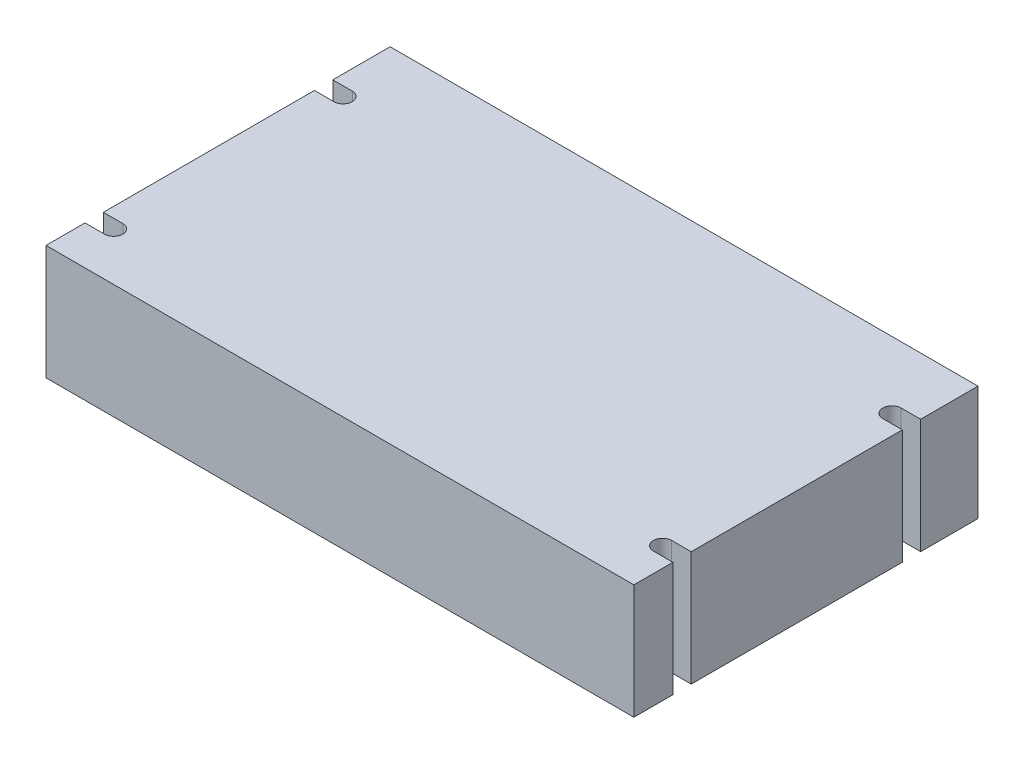
ISO-10303-21;
HEADER;
FILE_DESCRIPTION(('STEP AP214'),'2;1');
FILE_NAME('part.step','',(''),(''),'','','');
FILE_SCHEMA(('AUTOMOTIVE_DESIGN { 1 0 10303 214 1 1 1 1 }'));
ENDSEC;
DATA;
#1=APPLICATION_CONTEXT('core data for automotive mechanical design processes');
#2=APPLICATION_PROTOCOL_DEFINITION('international standard','automotive_design',2000,#1);
#3=PRODUCT_CONTEXT('',#1,'mechanical');
#4=PRODUCT('Part','Part','',(#3));
#5=PRODUCT_RELATED_PRODUCT_CATEGORY('part','',(#4));
#6=PRODUCT_DEFINITION_FORMATION('','',#4);
#7=PRODUCT_DEFINITION_CONTEXT('part definition',#1,'design');
#8=PRODUCT_DEFINITION('design','',#6,#7);
#9=PRODUCT_DEFINITION_SHAPE('','',#8);
#10=(LENGTH_UNIT() NAMED_UNIT(*) SI_UNIT(.MILLI.,.METRE.));
#11=(NAMED_UNIT(*) PLANE_ANGLE_UNIT() SI_UNIT($,.RADIAN.));
#12=(NAMED_UNIT(*) SI_UNIT($,.STERADIAN.) SOLID_ANGLE_UNIT());
#13=UNCERTAINTY_MEASURE_WITH_UNIT(LENGTH_MEASURE(1.E-05),#10,'distance_accuracy_value','');
#14=(GEOMETRIC_REPRESENTATION_CONTEXT(3) GLOBAL_UNCERTAINTY_ASSIGNED_CONTEXT((#13)) GLOBAL_UNIT_ASSIGNED_CONTEXT((#10,
#11,#12)) REPRESENTATION_CONTEXT('',''));
#15=CARTESIAN_POINT('',(0.,0.,0.));
#16=DIRECTION('',(0.,0.,1.));
#17=DIRECTION('',(1.,0.,0.));
#18=AXIS2_PLACEMENT_3D('',#15,#16,#17);
#19=CARTESIAN_POINT('',(65.0875,25.4,38.1));
#20=DIRECTION('',(-1.,0.,0.));
#21=DIRECTION('',(0.,0.,1.));
#22=AXIS2_PLACEMENT_3D('',#19,#20,#21);
#23=PLANE('',#22);
#24=DIRECTION('',(0.,1.,0.));
#25=VECTOR('',#24,1.);
#26=CARTESIAN_POINT('',(65.0875,0.,25.4));
#27=LINE('',#26,#25);
#28=CARTESIAN_POINT('',(65.0875,0.,25.4));
#29=VERTEX_POINT('',#28);
#30=CARTESIAN_POINT('',(65.0875,25.4,25.4));
#31=VERTEX_POINT('',#30);
#32=EDGE_CURVE('E207',#29,#31,#27,.T.);
#33=ORIENTED_EDGE('',*,*,#32,.F.);
#34=DIRECTION('',(0.,0.,-1.));
#35=VECTOR('',#34,1.);
#36=CARTESIAN_POINT('',(65.0875,0.,38.1));
#37=LINE('',#36,#35);
#38=CARTESIAN_POINT('',(65.0875,0.,-21.336));
#39=VERTEX_POINT('',#38);
#40=EDGE_CURVE('E302',#29,#39,#37,.T.);
#41=ORIENTED_EDGE('',*,*,#40,.T.);
#42=DIRECTION('',(0.,1.,0.));
#43=VECTOR('',#42,1.);
#44=CARTESIAN_POINT('',(65.0875,0.,-21.336));
#45=LINE('',#44,#43);
#46=CARTESIAN_POINT('',(65.0875,25.4,-21.336));
#47=VERTEX_POINT('',#46);
#48=EDGE_CURVE('E52',#39,#47,#45,.T.);
#49=ORIENTED_EDGE('',*,*,#48,.T.);
#50=DIRECTION('',(0.,0.,-1.));
#51=VECTOR('',#50,1.);
#52=CARTESIAN_POINT('',(65.0875,25.4,38.1));
#53=LINE('',#52,#51);
#54=EDGE_CURVE('E288',#31,#47,#53,.T.);
#55=ORIENTED_EDGE('',*,*,#54,.F.);
#56=EDGE_LOOP('',(#33,#41,#49,#55));
#57=FACE_BOUND('',#56,.T.);
#58=ADVANCED_FACE('F38',(#57),#23,.F.);
#59=DIRECTION('',(0.,1.,0.));
#60=VECTOR('',#59,1.);
#61=CARTESIAN_POINT('',(65.0875,0.,29.464));
#62=LINE('',#61,#60);
#63=CARTESIAN_POINT('',(65.0875,0.,29.464));
#64=VERTEX_POINT('',#63);
#65=CARTESIAN_POINT('',(65.0875,25.4,29.464));
#66=VERTEX_POINT('',#65);
#67=EDGE_CURVE('E60',#64,#66,#62,.T.);
#68=ORIENTED_EDGE('',*,*,#67,.T.);
#69=CARTESIAN_POINT('',(65.0875,25.4,38.1));
#70=VERTEX_POINT('',#69);
#71=EDGE_CURVE('E284',#70,#66,#53,.T.);
#72=ORIENTED_EDGE('',*,*,#71,.F.);
#73=DIRECTION('',(0.,-1.,0.));
#74=VECTOR('',#73,1.);
#75=CARTESIAN_POINT('',(65.0875,25.4,38.1));
#76=LINE('',#75,#74);
#77=CARTESIAN_POINT('',(65.0875,0.,38.1));
#78=VERTEX_POINT('',#77);
#79=EDGE_CURVE('E298',#70,#78,#76,.T.);
#80=ORIENTED_EDGE('',*,*,#79,.T.);
#81=EDGE_CURVE('E299',#78,#64,#37,.T.);
#82=ORIENTED_EDGE('',*,*,#81,.T.);
#83=EDGE_LOOP('',(#68,#72,#80,#82));
#84=FACE_BOUND('',#83,.T.);
#85=ADVANCED_FACE('F363',(#84),#23,.F.);
#86=DIRECTION('',(0.,1.,0.));
#87=VECTOR('',#86,1.);
#88=CARTESIAN_POINT('',(65.0875,0.,-25.4));
#89=LINE('',#88,#87);
#90=CARTESIAN_POINT('',(65.0875,0.,-25.4));
#91=VERTEX_POINT('',#90);
#92=CARTESIAN_POINT('',(65.0875,25.4,-25.4));
#93=VERTEX_POINT('',#92);
#94=EDGE_CURVE('E228',#91,#93,#89,.T.);
#95=ORIENTED_EDGE('',*,*,#94,.F.);
#96=CARTESIAN_POINT('',(65.0875,0.,-38.1));
#97=VERTEX_POINT('',#96);
#98=EDGE_CURVE('E253',#91,#97,#37,.T.);
#99=ORIENTED_EDGE('',*,*,#98,.T.);
#100=DIRECTION('',(0.,-1.,0.));
#101=VECTOR('',#100,1.);
#102=CARTESIAN_POINT('',(65.0875,25.4,-38.1));
#103=LINE('',#102,#101);
#104=CARTESIAN_POINT('',(65.0875,25.4,-38.1));
#105=VERTEX_POINT('',#104);
#106=EDGE_CURVE('E11',#105,#97,#103,.T.);
#107=ORIENTED_EDGE('',*,*,#106,.F.);
#108=EDGE_CURVE('E289',#93,#105,#53,.T.);
#109=ORIENTED_EDGE('',*,*,#108,.F.);
#110=EDGE_LOOP('',(#95,#99,#107,#109));
#111=FACE_BOUND('',#110,.T.);
#112=ADVANCED_FACE('F338',(#111),#23,.F.);
#113=CARTESIAN_POINT('',(0.,25.4,0.));
#114=DIRECTION('',(0.,-1.,0.));
#115=DIRECTION('',(0.,0.,-1.));
#116=AXIS2_PLACEMENT_3D('',#113,#114,#115);
#117=PLANE('',#116);
#118=DIRECTION('',(1.,0.,0.));
#119=VECTOR('',#118,1.);
#120=CARTESIAN_POINT('',(60.7695,25.4,25.4));
#121=LINE('',#120,#119);
#122=CARTESIAN_POINT('',(60.7695,25.4,25.4));
#123=VERTEX_POINT('',#122);
#124=EDGE_CURVE('E194',#123,#31,#121,.T.);
#125=ORIENTED_EDGE('',*,*,#124,.T.);
#126=ORIENTED_EDGE('',*,*,#54,.T.);
#127=DIRECTION('',(-1.,0.,0.));
#128=VECTOR('',#127,1.);
#129=CARTESIAN_POINT('',(60.7695,25.4,-21.336));
#130=LINE('',#129,#128);
#131=CARTESIAN_POINT('',(60.7695,25.4,-21.336));
#132=VERTEX_POINT('',#131);
#133=EDGE_CURVE('E221',#47,#132,#130,.T.);
#134=ORIENTED_EDGE('',*,*,#133,.T.);
#135=CARTESIAN_POINT('',(60.7695,25.4,-23.368));
#136=DIRECTION('',(0.,-1.,0.));
#137=DIRECTION('',(0.,0.,1.));
#138=AXIS2_PLACEMENT_3D('',#135,#136,#137);
#139=CIRCLE('',#138,2.032);
#140=CARTESIAN_POINT('',(60.7695,25.4,-25.4));
#141=VERTEX_POINT('',#140);
#142=EDGE_CURVE('E218',#132,#141,#139,.T.);
#143=ORIENTED_EDGE('',*,*,#142,.T.);
#144=DIRECTION('',(1.,0.,0.));
#145=VECTOR('',#144,1.);
#146=CARTESIAN_POINT('',(60.7695,25.4,-25.4));
#147=LINE('',#146,#145);
#148=EDGE_CURVE('E213',#141,#93,#147,.T.);
#149=ORIENTED_EDGE('',*,*,#148,.T.);
#150=ORIENTED_EDGE('',*,*,#108,.T.);
#151=DIRECTION('',(-1.,0.,0.));
#152=VECTOR('',#151,1.);
#153=CARTESIAN_POINT('',(-65.0875,25.4,-38.1));
#154=LINE('',#153,#152);
#155=CARTESIAN_POINT('',(-65.0875,25.4,-38.1));
#156=VERTEX_POINT('',#155);
#157=EDGE_CURVE('E287',#105,#156,#154,.T.);
#158=ORIENTED_EDGE('',*,*,#157,.T.);
#159=DIRECTION('',(0.,0.,1.));
#160=VECTOR('',#159,1.);
#161=CARTESIAN_POINT('',(-65.0875,25.4,38.1));
#162=LINE('',#161,#160);
#163=CARTESIAN_POINT('',(-65.0875,25.4,-25.4));
#164=VERTEX_POINT('',#163);
#165=EDGE_CURVE('E292',#156,#164,#162,.T.);
#166=ORIENTED_EDGE('',*,*,#165,.T.);
#167=DIRECTION('',(-1.,0.,0.));
#168=VECTOR('',#167,1.);
#169=CARTESIAN_POINT('',(-60.7695,25.4,-25.4));
#170=LINE('',#169,#168);
#171=CARTESIAN_POINT('',(-60.7695,25.4,-25.4));
#172=VERTEX_POINT('',#171);
#173=EDGE_CURVE('E273',#172,#164,#170,.T.);
#174=ORIENTED_EDGE('',*,*,#173,.F.);
#175=CARTESIAN_POINT('',(-60.7695,25.4,-23.368));
#176=DIRECTION('',(0.,1.,0.));
#177=DIRECTION('',(0.,0.,1.));
#178=AXIS2_PLACEMENT_3D('',#175,#176,#177);
#179=CIRCLE('',#178,2.032);
#180=CARTESIAN_POINT('',(-60.7695,25.4,-21.336));
#181=VERTEX_POINT('',#180);
#182=EDGE_CURVE('E206',#181,#172,#179,.T.);
#183=ORIENTED_EDGE('',*,*,#182,.F.);
#184=DIRECTION('',(1.,0.,0.));
#185=VECTOR('',#184,1.);
#186=CARTESIAN_POINT('',(-60.7695,25.4,-21.336));
#187=LINE('',#186,#185);
#188=CARTESIAN_POINT('',(-65.0875,25.4,-21.336));
#189=VERTEX_POINT('',#188);
#190=EDGE_CURVE('E264',#189,#181,#187,.T.);
#191=ORIENTED_EDGE('',*,*,#190,.F.);
#192=CARTESIAN_POINT('',(-65.0875,25.4,25.4));
#193=VERTEX_POINT('',#192);
#194=EDGE_CURVE('E296',#189,#193,#162,.T.);
#195=ORIENTED_EDGE('',*,*,#194,.T.);
#196=DIRECTION('',(-1.,0.,0.));
#197=VECTOR('',#196,1.);
#198=CARTESIAN_POINT('',(-60.7695,25.4,25.4));
#199=LINE('',#198,#197);
#200=CARTESIAN_POINT('',(-60.7695,25.4,25.4));
#201=VERTEX_POINT('',#200);
#202=EDGE_CURVE('E246',#201,#193,#199,.T.);
#203=ORIENTED_EDGE('',*,*,#202,.F.);
#204=CARTESIAN_POINT('',(-60.7695,25.4,27.432));
#205=DIRECTION('',(0.,1.,0.));
#206=DIRECTION('',(0.,0.,1.));
#207=AXIS2_PLACEMENT_3D('',#204,#205,#206);
#208=CIRCLE('',#207,2.032);
#209=CARTESIAN_POINT('',(-60.7695,25.4,29.464));
#210=VERTEX_POINT('',#209);
#211=EDGE_CURVE('E243',#210,#201,#208,.T.);
#212=ORIENTED_EDGE('',*,*,#211,.F.);
#213=DIRECTION('',(1.,0.,0.));
#214=VECTOR('',#213,1.);
#215=CARTESIAN_POINT('',(-65.0875,25.4,29.464));
#216=LINE('',#215,#214);
#217=CARTESIAN_POINT('',(-65.0875,25.4,29.464));
#218=VERTEX_POINT('',#217);
#219=EDGE_CURVE('E236',#218,#210,#216,.T.);
#220=ORIENTED_EDGE('',*,*,#219,.F.);
#221=CARTESIAN_POINT('',(-65.0875,25.4,38.1));
#222=VERTEX_POINT('',#221);
#223=EDGE_CURVE('E291',#218,#222,#162,.T.);
#224=ORIENTED_EDGE('',*,*,#223,.T.);
#225=DIRECTION('',(1.,0.,0.));
#226=VECTOR('',#225,1.);
#227=CARTESIAN_POINT('',(-65.0875,25.4,38.1));
#228=LINE('',#227,#226);
#229=EDGE_CURVE('E295',#222,#70,#228,.T.);
#230=ORIENTED_EDGE('',*,*,#229,.T.);
#231=ORIENTED_EDGE('',*,*,#71,.T.);
#232=DIRECTION('',(-1.,0.,0.));
#233=VECTOR('',#232,1.);
#234=CARTESIAN_POINT('',(65.0875,25.4,29.464));
#235=LINE('',#234,#233);
#236=CARTESIAN_POINT('',(60.7695,25.4,29.464));
#237=VERTEX_POINT('',#236);
#238=EDGE_CURVE('E197',#66,#237,#235,.T.);
#239=ORIENTED_EDGE('',*,*,#238,.T.);
#240=CARTESIAN_POINT('',(60.7695,25.4,27.432));
#241=DIRECTION('',(0.,-1.,0.));
#242=DIRECTION('',(0.,0.,1.));
#243=AXIS2_PLACEMENT_3D('',#240,#241,#242);
#244=CIRCLE('',#243,2.032);
#245=EDGE_CURVE('E188',#237,#123,#244,.T.);
#246=ORIENTED_EDGE('',*,*,#245,.T.);
#247=EDGE_LOOP('',(#125,#126,#134,#143,#149,#150,#158,#166,#174,#183,#191,#195,#203,#212,#220,
#224,#230,#231,#239,#246));
#248=FACE_BOUND('',#247,.T.);
#249=ADVANCED_FACE('F331',(#248),#117,.F.);
#250=CARTESIAN_POINT('',(0.,0.,0.));
#251=DIRECTION('',(0.,-1.,0.));
#252=DIRECTION('',(0.,0.,-1.));
#253=AXIS2_PLACEMENT_3D('',#250,#251,#252);
#254=PLANE('',#253);
#255=ORIENTED_EDGE('',*,*,#40,.F.);
#256=DIRECTION('',(1.,0.,0.));
#257=VECTOR('',#256,1.);
#258=CARTESIAN_POINT('',(60.7695,0.,25.4));
#259=LINE('',#258,#257);
#260=CARTESIAN_POINT('',(60.7695,0.,25.4));
#261=VERTEX_POINT('',#260);
#262=EDGE_CURVE('E180',#261,#29,#259,.T.);
#263=ORIENTED_EDGE('',*,*,#262,.F.);
#264=CARTESIAN_POINT('',(60.7695,0.,27.432));
#265=DIRECTION('',(0.,-1.,0.));
#266=DIRECTION('',(0.,0.,1.));
#267=AXIS2_PLACEMENT_3D('',#264,#265,#266);
#268=CIRCLE('',#267,2.032);
#269=CARTESIAN_POINT('',(60.7695,0.,29.464));
#270=VERTEX_POINT('',#269);
#271=EDGE_CURVE('E181',#270,#261,#268,.T.);
#272=ORIENTED_EDGE('',*,*,#271,.F.);
#273=DIRECTION('',(-1.,0.,0.));
#274=VECTOR('',#273,1.);
#275=CARTESIAN_POINT('',(65.0875,0.,29.464));
#276=LINE('',#275,#274);
#277=EDGE_CURVE('E171',#64,#270,#276,.T.);
#278=ORIENTED_EDGE('',*,*,#277,.F.);
#279=ORIENTED_EDGE('',*,*,#81,.F.);
#280=DIRECTION('',(1.,0.,0.));
#281=VECTOR('',#280,1.);
#282=CARTESIAN_POINT('',(-65.0875,0.,38.1));
#283=LINE('',#282,#281);
#284=CARTESIAN_POINT('',(-65.0875,0.,38.1));
#285=VERTEX_POINT('',#284);
#286=EDGE_CURVE('E308',#285,#78,#283,.T.);
#287=ORIENTED_EDGE('',*,*,#286,.F.);
#288=DIRECTION('',(0.,0.,1.));
#289=VECTOR('',#288,1.);
#290=CARTESIAN_POINT('',(-65.0875,0.,38.1));
#291=LINE('',#290,#289);
#292=CARTESIAN_POINT('',(-65.0875,0.,29.464));
#293=VERTEX_POINT('',#292);
#294=EDGE_CURVE('E304',#293,#285,#291,.T.);
#295=ORIENTED_EDGE('',*,*,#294,.F.);
#296=DIRECTION('',(1.,0.,0.));
#297=VECTOR('',#296,1.);
#298=CARTESIAN_POINT('',(-65.0875,0.,29.464));
#299=LINE('',#298,#297);
#300=CARTESIAN_POINT('',(-60.7695,0.,29.464));
#301=VERTEX_POINT('',#300);
#302=EDGE_CURVE('E239',#293,#301,#299,.T.);
#303=ORIENTED_EDGE('',*,*,#302,.T.);
#304=CARTESIAN_POINT('',(-60.7695,0.,27.432));
#305=DIRECTION('',(0.,1.,0.));
#306=DIRECTION('',(0.,0.,1.));
#307=AXIS2_PLACEMENT_3D('',#304,#305,#306);
#308=CIRCLE('',#307,2.032);
#309=CARTESIAN_POINT('',(-60.7695,0.,25.4));
#310=VERTEX_POINT('',#309);
#311=EDGE_CURVE('E232',#301,#310,#308,.T.);
#312=ORIENTED_EDGE('',*,*,#311,.T.);
#313=DIRECTION('',(-1.,0.,0.));
#314=VECTOR('',#313,1.);
#315=CARTESIAN_POINT('',(-60.7695,0.,25.4));
#316=LINE('',#315,#314);
#317=CARTESIAN_POINT('',(-65.0875,0.,25.4));
#318=VERTEX_POINT('',#317);
#319=EDGE_CURVE('E235',#310,#318,#316,.T.);
#320=ORIENTED_EDGE('',*,*,#319,.T.);
#321=CARTESIAN_POINT('',(-65.0875,0.,-21.336));
#322=VERTEX_POINT('',#321);
#323=EDGE_CURVE('E309',#322,#318,#291,.T.);
#324=ORIENTED_EDGE('',*,*,#323,.F.);
#325=DIRECTION('',(1.,0.,0.));
#326=VECTOR('',#325,1.);
#327=CARTESIAN_POINT('',(-60.7695,0.,-21.336));
#328=LINE('',#327,#326);
#329=CARTESIAN_POINT('',(-60.7695,0.,-21.336));
#330=VERTEX_POINT('',#329);
#331=EDGE_CURVE('E267',#322,#330,#328,.T.);
#332=ORIENTED_EDGE('',*,*,#331,.T.);
#333=CARTESIAN_POINT('',(-60.7695,0.,-23.368));
#334=DIRECTION('',(0.,1.,0.));
#335=DIRECTION('',(0.,0.,1.));
#336=AXIS2_PLACEMENT_3D('',#333,#334,#335);
#337=CIRCLE('',#336,2.032);
#338=CARTESIAN_POINT('',(-60.7695,0.,-25.4));
#339=VERTEX_POINT('',#338);
#340=EDGE_CURVE('E260',#330,#339,#337,.T.);
#341=ORIENTED_EDGE('',*,*,#340,.T.);
#342=DIRECTION('',(-1.,0.,0.));
#343=VECTOR('',#342,1.);
#344=CARTESIAN_POINT('',(-60.7695,0.,-25.4));
#345=LINE('',#344,#343);
#346=CARTESIAN_POINT('',(-65.0875,0.,-25.4));
#347=VERTEX_POINT('',#346);
#348=EDGE_CURVE('E263',#339,#347,#345,.T.);
#349=ORIENTED_EDGE('',*,*,#348,.T.);
#350=CARTESIAN_POINT('',(-65.0875,0.,-38.1));
#351=VERTEX_POINT('',#350);
#352=EDGE_CURVE('E305',#351,#347,#291,.T.);
#353=ORIENTED_EDGE('',*,*,#352,.F.);
#354=DIRECTION('',(-1.,0.,0.));
#355=VECTOR('',#354,1.);
#356=CARTESIAN_POINT('',(-65.0875,0.,-38.1));
#357=LINE('',#356,#355);
#358=EDGE_CURVE('E301',#97,#351,#357,.T.);
#359=ORIENTED_EDGE('',*,*,#358,.F.);
#360=ORIENTED_EDGE('',*,*,#98,.F.);
#361=DIRECTION('',(1.,0.,0.));
#362=VECTOR('',#361,1.);
#363=CARTESIAN_POINT('',(60.7695,0.,-25.4));
#364=LINE('',#363,#362);
#365=CARTESIAN_POINT('',(60.7695,0.,-25.4));
#366=VERTEX_POINT('',#365);
#367=EDGE_CURVE('E215',#366,#91,#364,.T.);
#368=ORIENTED_EDGE('',*,*,#367,.F.);
#369=CARTESIAN_POINT('',(60.7695,0.,-23.368));
#370=DIRECTION('',(0.,-1.,0.));
#371=DIRECTION('',(0.,0.,1.));
#372=AXIS2_PLACEMENT_3D('',#369,#370,#371);
#373=CIRCLE('',#372,2.032);
#374=CARTESIAN_POINT('',(60.7695,0.,-21.336));
#375=VERTEX_POINT('',#374);
#376=EDGE_CURVE('E210',#375,#366,#373,.T.);
#377=ORIENTED_EDGE('',*,*,#376,.F.);
#378=DIRECTION('',(-1.,0.,0.));
#379=VECTOR('',#378,1.);
#380=CARTESIAN_POINT('',(60.7695,0.,-21.336));
#381=LINE('',#380,#379);
#382=EDGE_CURVE('E212',#39,#375,#381,.T.);
#383=ORIENTED_EDGE('',*,*,#382,.F.);
#384=EDGE_LOOP('',(#255,#263,#272,#278,#279,#287,#295,#303,#312,#320,#324,#332,#341,#349,#353,
#359,#360,#368,#377,#383));
#385=FACE_BOUND('',#384,.T.);
#386=ADVANCED_FACE('F193',(#385),#254,.T.);
#387=CARTESIAN_POINT('',(-65.0875,25.4,38.1));
#388=DIRECTION('',(1.,0.,0.));
#389=DIRECTION('',(0.,0.,-1.));
#390=AXIS2_PLACEMENT_3D('',#387,#388,#389);
#391=PLANE('',#390);
#392=ORIENTED_EDGE('',*,*,#223,.F.);
#393=DIRECTION('',(0.,1.,0.));
#394=VECTOR('',#393,1.);
#395=CARTESIAN_POINT('',(-65.0875,0.,29.464));
#396=LINE('',#395,#394);
#397=EDGE_CURVE('E254',#293,#218,#396,.T.);
#398=ORIENTED_EDGE('',*,*,#397,.F.);
#399=ORIENTED_EDGE('',*,*,#294,.T.);
#400=DIRECTION('',(0.,-1.,0.));
#401=VECTOR('',#400,1.);
#402=CARTESIAN_POINT('',(-65.0875,25.4,38.1));
#403=LINE('',#402,#401);
#404=EDGE_CURVE('E313',#222,#285,#403,.T.);
#405=ORIENTED_EDGE('',*,*,#404,.F.);
#406=EDGE_LOOP('',(#392,#398,#399,#405));
#407=FACE_BOUND('',#406,.T.);
#408=ADVANCED_FACE('F377',(#407),#391,.F.);
#409=ORIENTED_EDGE('',*,*,#323,.T.);
#410=DIRECTION('',(0.,1.,0.));
#411=VECTOR('',#410,1.);
#412=CARTESIAN_POINT('',(-65.0875,0.,25.4));
#413=LINE('',#412,#411);
#414=EDGE_CURVE('E256',#318,#193,#413,.T.);
#415=ORIENTED_EDGE('',*,*,#414,.T.);
#416=ORIENTED_EDGE('',*,*,#194,.F.);
#417=DIRECTION('',(0.,1.,0.));
#418=VECTOR('',#417,1.);
#419=CARTESIAN_POINT('',(-65.0875,0.,-21.336));
#420=LINE('',#419,#418);
#421=EDGE_CURVE('E278',#322,#189,#420,.T.);
#422=ORIENTED_EDGE('',*,*,#421,.F.);
#423=EDGE_LOOP('',(#409,#415,#416,#422));
#424=FACE_BOUND('',#423,.T.);
#425=ADVANCED_FACE('F388',(#424),#391,.F.);
#426=CARTESIAN_POINT('',(-65.0875,25.4,-38.1));
#427=DIRECTION('',(0.,0.,1.));
#428=DIRECTION('',(1.,0.,0.));
#429=AXIS2_PLACEMENT_3D('',#426,#427,#428);
#430=PLANE('',#429);
#431=ORIENTED_EDGE('',*,*,#358,.T.);
#432=DIRECTION('',(0.,-1.,0.));
#433=VECTOR('',#432,1.);
#434=CARTESIAN_POINT('',(-65.0875,25.4,-38.1));
#435=LINE('',#434,#433);
#436=EDGE_CURVE('E45',#156,#351,#435,.T.);
#437=ORIENTED_EDGE('',*,*,#436,.F.);
#438=ORIENTED_EDGE('',*,*,#157,.F.);
#439=ORIENTED_EDGE('',*,*,#106,.T.);
#440=EDGE_LOOP('',(#431,#437,#438,#439));
#441=FACE_BOUND('',#440,.T.);
#442=ADVANCED_FACE('F335',(#441),#430,.F.);
#443=ORIENTED_EDGE('',*,*,#352,.T.);
#444=DIRECTION('',(0.,1.,0.));
#445=VECTOR('',#444,1.);
#446=CARTESIAN_POINT('',(-65.0875,0.,-25.4));
#447=LINE('',#446,#445);
#448=EDGE_CURVE('E280',#347,#164,#447,.T.);
#449=ORIENTED_EDGE('',*,*,#448,.T.);
#450=ORIENTED_EDGE('',*,*,#165,.F.);
#451=ORIENTED_EDGE('',*,*,#436,.T.);
#452=EDGE_LOOP('',(#443,#449,#450,#451));
#453=FACE_BOUND('',#452,.T.);
#454=ADVANCED_FACE('F320',(#453),#391,.F.);
#455=CARTESIAN_POINT('',(-65.0875,25.4,38.1));
#456=DIRECTION('',(0.,0.,-1.));
#457=DIRECTION('',(-1.,0.,0.));
#458=AXIS2_PLACEMENT_3D('',#455,#456,#457);
#459=PLANE('',#458);
#460=ORIENTED_EDGE('',*,*,#286,.T.);
#461=ORIENTED_EDGE('',*,*,#79,.F.);
#462=ORIENTED_EDGE('',*,*,#229,.F.);
#463=ORIENTED_EDGE('',*,*,#404,.T.);
#464=EDGE_LOOP('',(#460,#461,#462,#463));
#465=FACE_BOUND('',#464,.T.);
#466=ADVANCED_FACE('F383',(#465),#459,.F.);
#467=CARTESIAN_POINT('',(-60.7695,0.,-23.368));
#468=DIRECTION('',(0.,1.,0.));
#469=DIRECTION('',(0.,0.,1.));
#470=AXIS2_PLACEMENT_3D('',#467,#468,#469);
#471=CYLINDRICAL_SURFACE('',#470,2.032);
#472=ORIENTED_EDGE('',*,*,#182,.T.);
#473=DIRECTION('',(0.,1.,0.));
#474=VECTOR('',#473,1.);
#475=CARTESIAN_POINT('',(-60.7695,0.,-25.4));
#476=LINE('',#475,#474);
#477=EDGE_CURVE('E270',#339,#172,#476,.T.);
#478=ORIENTED_EDGE('',*,*,#477,.F.);
#479=ORIENTED_EDGE('',*,*,#340,.F.);
#480=DIRECTION('',(0.,1.,0.));
#481=VECTOR('',#480,1.);
#482=CARTESIAN_POINT('',(-60.7695,0.,-21.336));
#483=LINE('',#482,#481);
#484=EDGE_CURVE('E247',#330,#181,#483,.T.);
#485=ORIENTED_EDGE('',*,*,#484,.T.);
#486=EDGE_LOOP('',(#472,#478,#479,#485));
#487=FACE_BOUND('',#486,.T.);
#488=ADVANCED_FACE('F380',(#487),#471,.F.);
#489=CARTESIAN_POINT('',(-60.7695,0.,-21.336));
#490=DIRECTION('',(0.,0.,1.));
#491=DIRECTION('',(1.,0.,0.));
#492=AXIS2_PLACEMENT_3D('',#489,#490,#491);
#493=PLANE('',#492);
#494=ORIENTED_EDGE('',*,*,#190,.T.);
#495=ORIENTED_EDGE('',*,*,#484,.F.);
#496=ORIENTED_EDGE('',*,*,#331,.F.);
#497=ORIENTED_EDGE('',*,*,#421,.T.);
#498=EDGE_LOOP('',(#494,#495,#496,#497));
#499=FACE_BOUND('',#498,.T.);
#500=ADVANCED_FACE('F417',(#499),#493,.F.);
#501=CARTESIAN_POINT('',(-60.7695,0.,-25.4));
#502=DIRECTION('',(0.,0.,-1.));
#503=DIRECTION('',(-1.,0.,0.));
#504=AXIS2_PLACEMENT_3D('',#501,#502,#503);
#505=PLANE('',#504);
#506=ORIENTED_EDGE('',*,*,#173,.T.);
#507=ORIENTED_EDGE('',*,*,#448,.F.);
#508=ORIENTED_EDGE('',*,*,#348,.F.);
#509=ORIENTED_EDGE('',*,*,#477,.T.);
#510=EDGE_LOOP('',(#506,#507,#508,#509));
#511=FACE_BOUND('',#510,.T.);
#512=ADVANCED_FACE('F328',(#511),#505,.F.);
#513=CARTESIAN_POINT('',(-60.7695,0.,27.432));
#514=DIRECTION('',(0.,1.,0.));
#515=DIRECTION('',(0.,0.,1.));
#516=AXIS2_PLACEMENT_3D('',#513,#514,#515);
#517=CYLINDRICAL_SURFACE('',#516,2.032);
#518=ORIENTED_EDGE('',*,*,#211,.T.);
#519=DIRECTION('',(0.,1.,0.));
#520=VECTOR('',#519,1.);
#521=CARTESIAN_POINT('',(-60.7695,0.,25.4));
#522=LINE('',#521,#520);
#523=EDGE_CURVE('E242',#310,#201,#522,.T.);
#524=ORIENTED_EDGE('',*,*,#523,.F.);
#525=ORIENTED_EDGE('',*,*,#311,.F.);
#526=DIRECTION('',(0.,1.,0.));
#527=VECTOR('',#526,1.);
#528=CARTESIAN_POINT('',(-60.7695,0.,29.464));
#529=LINE('',#528,#527);
#530=EDGE_CURVE('E251',#301,#210,#529,.T.);
#531=ORIENTED_EDGE('',*,*,#530,.T.);
#532=EDGE_LOOP('',(#518,#524,#525,#531));
#533=FACE_BOUND('',#532,.T.);
#534=ADVANCED_FACE('F427',(#533),#517,.F.);
#535=CARTESIAN_POINT('',(-65.0875,0.,29.464));
#536=DIRECTION('',(0.,0.,1.));
#537=DIRECTION('',(1.,0.,0.));
#538=AXIS2_PLACEMENT_3D('',#535,#536,#537);
#539=PLANE('',#538);
#540=ORIENTED_EDGE('',*,*,#219,.T.);
#541=ORIENTED_EDGE('',*,*,#530,.F.);
#542=ORIENTED_EDGE('',*,*,#302,.F.);
#543=ORIENTED_EDGE('',*,*,#397,.T.);
#544=EDGE_LOOP('',(#540,#541,#542,#543));
#545=FACE_BOUND('',#544,.T.);
#546=ADVANCED_FACE('F431',(#545),#539,.F.);
#547=CARTESIAN_POINT('',(-60.7695,0.,25.4));
#548=DIRECTION('',(0.,0.,-1.));
#549=DIRECTION('',(-1.,0.,0.));
#550=AXIS2_PLACEMENT_3D('',#547,#548,#549);
#551=PLANE('',#550);
#552=ORIENTED_EDGE('',*,*,#202,.T.);
#553=ORIENTED_EDGE('',*,*,#414,.F.);
#554=ORIENTED_EDGE('',*,*,#319,.F.);
#555=ORIENTED_EDGE('',*,*,#523,.T.);
#556=EDGE_LOOP('',(#552,#553,#554,#555));
#557=FACE_BOUND('',#556,.T.);
#558=ADVANCED_FACE('F433',(#557),#551,.F.);
#559=CARTESIAN_POINT('',(60.7695,0.,-23.368));
#560=DIRECTION('',(0.,1.,0.));
#561=DIRECTION('',(0.,0.,1.));
#562=AXIS2_PLACEMENT_3D('',#559,#560,#561);
#563=CYLINDRICAL_SURFACE('',#562,2.032);
#564=ORIENTED_EDGE('',*,*,#142,.F.);
#565=DIRECTION('',(0.,1.,0.));
#566=VECTOR('',#565,1.);
#567=CARTESIAN_POINT('',(60.7695,0.,-21.336));
#568=LINE('',#567,#566);
#569=EDGE_CURVE('E217',#375,#132,#568,.T.);
#570=ORIENTED_EDGE('',*,*,#569,.F.);
#571=ORIENTED_EDGE('',*,*,#376,.T.);
#572=DIRECTION('',(0.,1.,0.));
#573=VECTOR('',#572,1.);
#574=CARTESIAN_POINT('',(60.7695,0.,-25.4));
#575=LINE('',#574,#573);
#576=EDGE_CURVE('E202',#366,#141,#575,.T.);
#577=ORIENTED_EDGE('',*,*,#576,.T.);
#578=EDGE_LOOP('',(#564,#570,#571,#577));
#579=FACE_BOUND('',#578,.T.);
#580=ADVANCED_FACE('F350',(#579),#563,.F.);
#581=CARTESIAN_POINT('',(60.7695,0.,-25.4));
#582=DIRECTION('',(0.,0.,1.));
#583=DIRECTION('',(1.,0.,0.));
#584=AXIS2_PLACEMENT_3D('',#581,#582,#583);
#585=PLANE('',#584);
#586=ORIENTED_EDGE('',*,*,#148,.F.);
#587=ORIENTED_EDGE('',*,*,#576,.F.);
#588=ORIENTED_EDGE('',*,*,#367,.T.);
#589=ORIENTED_EDGE('',*,*,#94,.T.);
#590=EDGE_LOOP('',(#586,#587,#588,#589));
#591=FACE_BOUND('',#590,.T.);
#592=ADVANCED_FACE('F442',(#591),#585,.T.);
#593=CARTESIAN_POINT('',(60.7695,0.,-21.336));
#594=DIRECTION('',(0.,0.,-1.));
#595=DIRECTION('',(-1.,0.,0.));
#596=AXIS2_PLACEMENT_3D('',#593,#594,#595);
#597=PLANE('',#596);
#598=ORIENTED_EDGE('',*,*,#133,.F.);
#599=ORIENTED_EDGE('',*,*,#48,.F.);
#600=ORIENTED_EDGE('',*,*,#382,.T.);
#601=ORIENTED_EDGE('',*,*,#569,.T.);
#602=EDGE_LOOP('',(#598,#599,#600,#601));
#603=FACE_BOUND('',#602,.T.);
#604=ADVANCED_FACE('F347',(#603),#597,.T.);
#605=CARTESIAN_POINT('',(60.7695,0.,27.432));
#606=DIRECTION('',(0.,1.,0.));
#607=DIRECTION('',(0.,0.,1.));
#608=AXIS2_PLACEMENT_3D('',#605,#606,#607);
#609=CYLINDRICAL_SURFACE('',#608,2.032);
#610=ORIENTED_EDGE('',*,*,#245,.F.);
#611=DIRECTION('',(0.,1.,0.));
#612=VECTOR('',#611,1.);
#613=CARTESIAN_POINT('',(60.7695,0.,29.464));
#614=LINE('',#613,#612);
#615=EDGE_CURVE('E174',#270,#237,#614,.T.);
#616=ORIENTED_EDGE('',*,*,#615,.F.);
#617=ORIENTED_EDGE('',*,*,#271,.T.);
#618=DIRECTION('',(0.,1.,0.));
#619=VECTOR('',#618,1.);
#620=CARTESIAN_POINT('',(60.7695,0.,25.4));
#621=LINE('',#620,#619);
#622=EDGE_CURVE('E204',#261,#123,#621,.T.);
#623=ORIENTED_EDGE('',*,*,#622,.T.);
#624=EDGE_LOOP('',(#610,#616,#617,#623));
#625=FACE_BOUND('',#624,.T.);
#626=ADVANCED_FACE('F184',(#625),#609,.F.);
#627=CARTESIAN_POINT('',(60.7695,0.,25.4));
#628=DIRECTION('',(0.,0.,1.));
#629=DIRECTION('',(1.,0.,0.));
#630=AXIS2_PLACEMENT_3D('',#627,#628,#629);
#631=PLANE('',#630);
#632=ORIENTED_EDGE('',*,*,#124,.F.);
#633=ORIENTED_EDGE('',*,*,#622,.F.);
#634=ORIENTED_EDGE('',*,*,#262,.T.);
#635=ORIENTED_EDGE('',*,*,#32,.T.);
#636=EDGE_LOOP('',(#632,#633,#634,#635));
#637=FACE_BOUND('',#636,.T.);
#638=ADVANCED_FACE('F353',(#637),#631,.T.);
#639=CARTESIAN_POINT('',(65.0875,0.,29.464));
#640=DIRECTION('',(0.,0.,-1.));
#641=DIRECTION('',(-1.,0.,0.));
#642=AXIS2_PLACEMENT_3D('',#639,#640,#641);
#643=PLANE('',#642);
#644=ORIENTED_EDGE('',*,*,#238,.F.);
#645=ORIENTED_EDGE('',*,*,#67,.F.);
#646=ORIENTED_EDGE('',*,*,#277,.T.);
#647=ORIENTED_EDGE('',*,*,#615,.T.);
#648=EDGE_LOOP('',(#644,#645,#646,#647));
#649=FACE_BOUND('',#648,.T.);
#650=ADVANCED_FACE('F173',(#649),#643,.T.);
#651=CLOSED_SHELL('',(#58,#85,#112,#249,#386,#408,#425,#442,#454,#466,#488,#500,#512,#534,#546,
#558,#580,#592,#604,#626,#638,#650));
#652=MANIFOLD_SOLID_BREP('B2',#651);
#653=ADVANCED_BREP_SHAPE_REPRESENTATION('',(#18,#652),#14);
#654=SHAPE_DEFINITION_REPRESENTATION(#9,#653);
ENDSEC;
END-ISO-10303-21;
